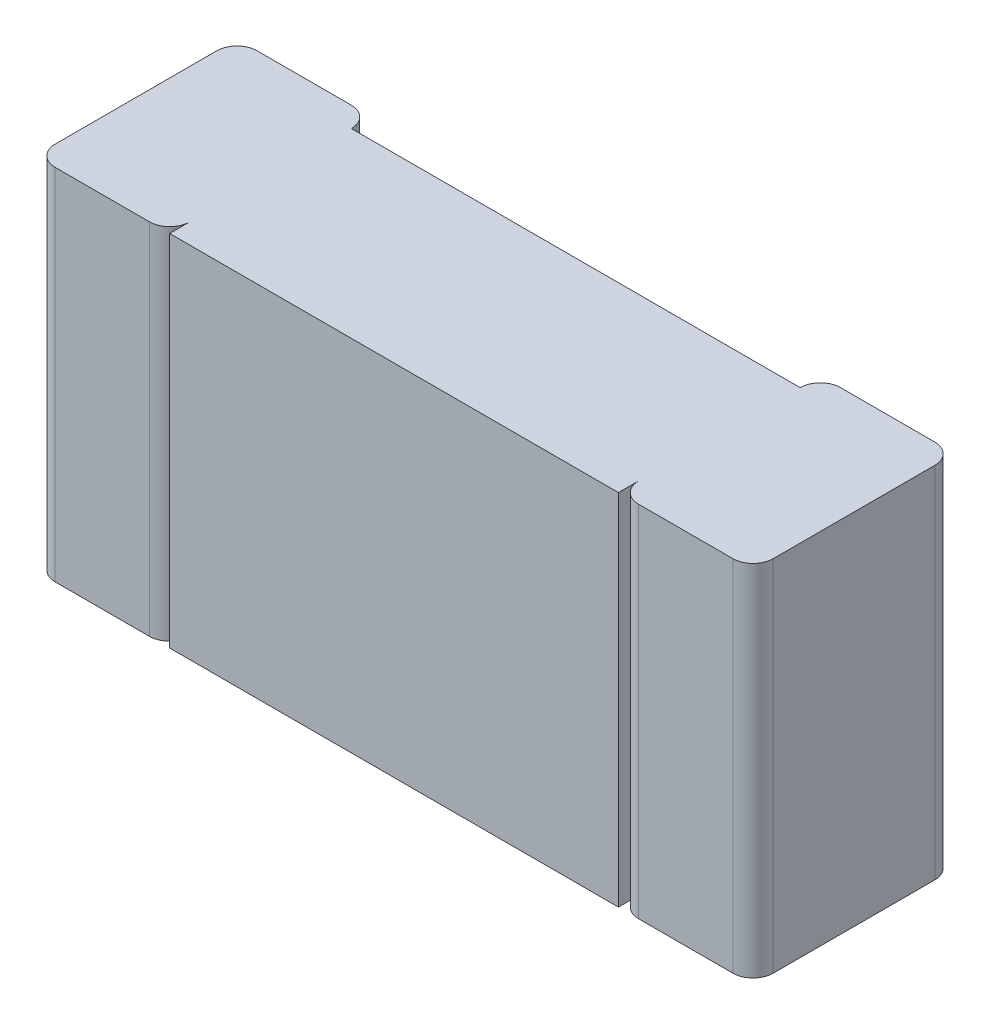
ISO-10303-21;
HEADER;
FILE_DESCRIPTION(('STEP AP214'),'2;1');
FILE_NAME('part.step','',(''),(''),'','','');
FILE_SCHEMA(('AUTOMOTIVE_DESIGN { 1 0 10303 214 1 1 1 1 }'));
ENDSEC;
DATA;
#1=APPLICATION_CONTEXT('core data for automotive mechanical design processes');
#2=APPLICATION_PROTOCOL_DEFINITION('international standard','automotive_design',2000,#1);
#3=PRODUCT_CONTEXT('',#1,'mechanical');
#4=PRODUCT('Part','Part','',(#3));
#5=PRODUCT_RELATED_PRODUCT_CATEGORY('part','',(#4));
#6=PRODUCT_DEFINITION_FORMATION('','',#4);
#7=PRODUCT_DEFINITION_CONTEXT('part definition',#1,'design');
#8=PRODUCT_DEFINITION('design','',#6,#7);
#9=PRODUCT_DEFINITION_SHAPE('','',#8);
#10=(LENGTH_UNIT() NAMED_UNIT(*) SI_UNIT(.MILLI.,.METRE.));
#11=(NAMED_UNIT(*) PLANE_ANGLE_UNIT() SI_UNIT($,.RADIAN.));
#12=(NAMED_UNIT(*) SI_UNIT($,.STERADIAN.) SOLID_ANGLE_UNIT());
#13=UNCERTAINTY_MEASURE_WITH_UNIT(LENGTH_MEASURE(1.E-05),#10,'distance_accuracy_value','');
#14=(GEOMETRIC_REPRESENTATION_CONTEXT(3) GLOBAL_UNCERTAINTY_ASSIGNED_CONTEXT((#13)) GLOBAL_UNIT_ASSIGNED_CONTEXT((#10,
#11,#12)) REPRESENTATION_CONTEXT('',''));
#15=CARTESIAN_POINT('',(0.,0.,0.));
#16=DIRECTION('',(0.,0.,1.));
#17=DIRECTION('',(1.,0.,0.));
#18=AXIS2_PLACEMENT_3D('',#15,#16,#17);
#19=CARTESIAN_POINT('',(-0.755,-0.4,0.045));
#20=DIRECTION('',(0.,1.,0.));
#21=DIRECTION('',(0.,0.,1.));
#22=AXIS2_PLACEMENT_3D('',#19,#20,#21);
#23=CYLINDRICAL_SURFACE('',#22,0.045);
#24=DIRECTION('',(0.,1.,0.));
#25=VECTOR('',#24,1.);
#26=CARTESIAN_POINT('',(-0.755,-0.4,0.));
#27=LINE('',#26,#25);
#28=CARTESIAN_POINT('',(-0.755,0.4,0.));
#29=VERTEX_POINT('',#28);
#30=CARTESIAN_POINT('',(-0.755,-0.4,0.));
#31=VERTEX_POINT('',#30);
#32=EDGE_CURVE('E129',#29,#31,#27,.F.);
#33=ORIENTED_EDGE('',*,*,#32,.T.);
#34=CARTESIAN_POINT('',(-0.755,-0.4,0.045));
#35=DIRECTION('',(0.,1.,0.));
#36=DIRECTION('',(0.,0.,1.));
#37=AXIS2_PLACEMENT_3D('',#34,#35,#36);
#38=CIRCLE('',#37,0.045);
#39=CARTESIAN_POINT('',(-0.8,-0.4,0.045));
#40=VERTEX_POINT('',#39);
#41=EDGE_CURVE('E20',#31,#40,#38,.T.);
#42=ORIENTED_EDGE('',*,*,#41,.T.);
#43=DIRECTION('',(0.,1.,0.));
#44=VECTOR('',#43,1.);
#45=CARTESIAN_POINT('',(-0.8,-0.4,0.045));
#46=LINE('',#45,#44);
#47=CARTESIAN_POINT('',(-0.8,0.4,0.045));
#48=VERTEX_POINT('',#47);
#49=EDGE_CURVE('E136',#40,#48,#46,.T.);
#50=ORIENTED_EDGE('',*,*,#49,.T.);
#51=CARTESIAN_POINT('',(-0.755,0.4,0.045));
#52=DIRECTION('',(0.,1.,0.));
#53=DIRECTION('',(0.,0.,1.));
#54=AXIS2_PLACEMENT_3D('',#51,#52,#53);
#55=CIRCLE('',#54,0.045);
#56=EDGE_CURVE('E232',#29,#48,#55,.T.);
#57=ORIENTED_EDGE('',*,*,#56,.F.);
#58=EDGE_LOOP('',(#33,#42,#50,#57));
#59=FACE_BOUND('',#58,.T.);
#60=ADVANCED_FACE('F17',(#59),#23,.T.);
#61=CARTESIAN_POINT('',(-0.8,-0.4,0.));
#62=DIRECTION('',(1.,0.,0.));
#63=DIRECTION('',(0.,0.,-1.));
#64=AXIS2_PLACEMENT_3D('',#61,#62,#63);
#65=PLANE('',#64);
#66=DIRECTION('',(0.,0.,1.));
#67=VECTOR('',#66,1.);
#68=CARTESIAN_POINT('',(-0.8,0.4,0.));
#69=LINE('',#68,#67);
#70=CARTESIAN_POINT('',(-0.8,0.4,0.405));
#71=VERTEX_POINT('',#70);
#72=EDGE_CURVE('E141',#48,#71,#69,.T.);
#73=ORIENTED_EDGE('',*,*,#72,.F.);
#74=ORIENTED_EDGE('',*,*,#49,.F.);
#75=DIRECTION('',(0.,0.,1.));
#76=VECTOR('',#75,1.);
#77=CARTESIAN_POINT('',(-0.8,-0.4,0.));
#78=LINE('',#77,#76);
#79=CARTESIAN_POINT('',(-0.8,-0.4,0.405));
#80=VERTEX_POINT('',#79);
#81=EDGE_CURVE('E140',#40,#80,#78,.T.);
#82=ORIENTED_EDGE('',*,*,#81,.T.);
#83=DIRECTION('',(0.,1.,0.));
#84=VECTOR('',#83,1.);
#85=CARTESIAN_POINT('',(-0.8,-0.4,0.405));
#86=LINE('',#85,#84);
#87=EDGE_CURVE('E142',#71,#80,#86,.F.);
#88=ORIENTED_EDGE('',*,*,#87,.F.);
#89=EDGE_LOOP('',(#73,#74,#82,#88));
#90=FACE_BOUND('',#89,.T.);
#91=ADVANCED_FACE('F138',(#90),#65,.F.);
#92=CARTESIAN_POINT('',(-0.755,-0.4,0.405));
#93=DIRECTION('',(0.,1.,0.));
#94=DIRECTION('',(0.,0.,1.));
#95=AXIS2_PLACEMENT_3D('',#92,#93,#94);
#96=CYLINDRICAL_SURFACE('',#95,0.045);
#97=CARTESIAN_POINT('',(-0.755,0.4,0.405));
#98=DIRECTION('',(0.,1.,0.));
#99=DIRECTION('',(0.,0.,1.));
#100=AXIS2_PLACEMENT_3D('',#97,#98,#99);
#101=CIRCLE('',#100,0.045);
#102=CARTESIAN_POINT('',(-0.755,0.4,0.45));
#103=VERTEX_POINT('',#102);
#104=EDGE_CURVE('E230',#71,#103,#101,.T.);
#105=ORIENTED_EDGE('',*,*,#104,.F.);
#106=ORIENTED_EDGE('',*,*,#87,.T.);
#107=CARTESIAN_POINT('',(-0.755,-0.4,0.405));
#108=DIRECTION('',(0.,1.,0.));
#109=DIRECTION('',(0.,0.,1.));
#110=AXIS2_PLACEMENT_3D('',#107,#108,#109);
#111=CIRCLE('',#110,0.045);
#112=CARTESIAN_POINT('',(-0.755,-0.4,0.45));
#113=VERTEX_POINT('',#112);
#114=EDGE_CURVE('E151',#80,#113,#111,.T.);
#115=ORIENTED_EDGE('',*,*,#114,.T.);
#116=DIRECTION('',(0.,1.,0.));
#117=VECTOR('',#116,1.);
#118=CARTESIAN_POINT('',(-0.755,-0.4,0.45));
#119=LINE('',#118,#117);
#120=EDGE_CURVE('E200',#103,#113,#119,.F.);
#121=ORIENTED_EDGE('',*,*,#120,.F.);
#122=EDGE_LOOP('',(#105,#106,#115,#121));
#123=FACE_BOUND('',#122,.T.);
#124=ADVANCED_FACE('F457',(#123),#96,.T.);
#125=CARTESIAN_POINT('',(-0.8,-0.4,0.45));
#126=DIRECTION('',(0.,0.,1.));
#127=DIRECTION('',(1.,0.,0.));
#128=AXIS2_PLACEMENT_3D('',#125,#126,#127);
#129=PLANE('',#128);
#130=DIRECTION('',(1.,0.,0.));
#131=VECTOR('',#130,1.);
#132=CARTESIAN_POINT('',(-0.8,-0.4,0.45));
#133=LINE('',#132,#131);
#134=CARTESIAN_POINT('',(-0.545,-0.4,0.45));
#135=VERTEX_POINT('',#134);
#136=EDGE_CURVE('E248',#113,#135,#133,.T.);
#137=ORIENTED_EDGE('',*,*,#136,.T.);
#138=DIRECTION('',(0.,1.,0.));
#139=VECTOR('',#138,1.);
#140=CARTESIAN_POINT('',(-0.545,-0.4,0.45));
#141=LINE('',#140,#139);
#142=CARTESIAN_POINT('',(-0.545,0.4,0.45));
#143=VERTEX_POINT('',#142);
#144=EDGE_CURVE('E198',#143,#135,#141,.F.);
#145=ORIENTED_EDGE('',*,*,#144,.F.);
#146=DIRECTION('',(1.,0.,0.));
#147=VECTOR('',#146,1.);
#148=CARTESIAN_POINT('',(-0.8,0.4,0.45));
#149=LINE('',#148,#147);
#150=EDGE_CURVE('E229',#103,#143,#149,.T.);
#151=ORIENTED_EDGE('',*,*,#150,.F.);
#152=ORIENTED_EDGE('',*,*,#120,.T.);
#153=EDGE_LOOP('',(#137,#145,#151,#152));
#154=FACE_BOUND('',#153,.T.);
#155=ADVANCED_FACE('F447',(#154),#129,.T.);
#156=CARTESIAN_POINT('',(-0.545,-0.4,0.405));
#157=DIRECTION('',(0.,1.,0.));
#158=DIRECTION('',(0.,0.,1.));
#159=AXIS2_PLACEMENT_3D('',#156,#157,#158);
#160=CYLINDRICAL_SURFACE('',#159,0.045);
#161=ORIENTED_EDGE('',*,*,#144,.T.);
#162=CARTESIAN_POINT('',(-0.545,-0.4,0.405));
#163=DIRECTION('',(0.,1.,0.));
#164=DIRECTION('',(0.,0.,1.));
#165=AXIS2_PLACEMENT_3D('',#162,#163,#164);
#166=CIRCLE('',#165,0.045);
#167=CARTESIAN_POINT('',(-0.5,-0.4,0.405));
#168=VERTEX_POINT('',#167);
#169=EDGE_CURVE('E246',#135,#168,#166,.T.);
#170=ORIENTED_EDGE('',*,*,#169,.T.);
#171=DIRECTION('',(0.,1.,0.));
#172=VECTOR('',#171,1.);
#173=CARTESIAN_POINT('',(-0.5,-0.4,0.405));
#174=LINE('',#173,#172);
#175=CARTESIAN_POINT('',(-0.5,0.4,0.405));
#176=VERTEX_POINT('',#175);
#177=EDGE_CURVE('E193',#168,#176,#174,.T.);
#178=ORIENTED_EDGE('',*,*,#177,.T.);
#179=CARTESIAN_POINT('',(-0.545,0.4,0.405));
#180=DIRECTION('',(0.,1.,0.));
#181=DIRECTION('',(0.,0.,1.));
#182=AXIS2_PLACEMENT_3D('',#179,#180,#181);
#183=CIRCLE('',#182,0.045);
#184=EDGE_CURVE('E227',#143,#176,#183,.T.);
#185=ORIENTED_EDGE('',*,*,#184,.F.);
#186=EDGE_LOOP('',(#161,#170,#178,#185));
#187=FACE_BOUND('',#186,.T.);
#188=ADVANCED_FACE('F435',(#187),#160,.T.);
#189=CARTESIAN_POINT('',(-0.5,-0.4,0.405));
#190=DIRECTION('',(1.,0.,0.));
#191=DIRECTION('',(0.,0.,-1.));
#192=AXIS2_PLACEMENT_3D('',#189,#190,#191);
#193=PLANE('',#192);
#194=DIRECTION('',(0.,0.,1.));
#195=VECTOR('',#194,1.);
#196=CARTESIAN_POINT('',(-0.5,0.4,0.405));
#197=LINE('',#196,#195);
#198=CARTESIAN_POINT('',(-0.5,0.4,0.45));
#199=VERTEX_POINT('',#198);
#200=EDGE_CURVE('E188',#176,#199,#197,.T.);
#201=ORIENTED_EDGE('',*,*,#200,.F.);
#202=ORIENTED_EDGE('',*,*,#177,.F.);
#203=DIRECTION('',(0.,0.,1.));
#204=VECTOR('',#203,1.);
#205=CARTESIAN_POINT('',(-0.5,-0.4,0.405));
#206=LINE('',#205,#204);
#207=CARTESIAN_POINT('',(-0.5,-0.4,0.45));
#208=VERTEX_POINT('',#207);
#209=EDGE_CURVE('E206',#168,#208,#206,.T.);
#210=ORIENTED_EDGE('',*,*,#209,.T.);
#211=DIRECTION('',(0.,1.,0.));
#212=VECTOR('',#211,1.);
#213=CARTESIAN_POINT('',(-0.5,-0.4,0.45));
#214=LINE('',#213,#212);
#215=EDGE_CURVE('E181',#199,#208,#214,.F.);
#216=ORIENTED_EDGE('',*,*,#215,.F.);
#217=EDGE_LOOP('',(#201,#202,#210,#216));
#218=FACE_BOUND('',#217,.T.);
#219=ADVANCED_FACE('F425',(#218),#193,.F.);
#220=CARTESIAN_POINT('',(-0.5,-0.4,0.45));
#221=DIRECTION('',(0.,0.,1.));
#222=DIRECTION('',(1.,0.,0.));
#223=AXIS2_PLACEMENT_3D('',#220,#221,#222);
#224=PLANE('',#223);
#225=DIRECTION('',(0.,1.,0.));
#226=VECTOR('',#225,1.);
#227=CARTESIAN_POINT('',(0.5,-0.4,0.45));
#228=LINE('',#227,#226);
#229=CARTESIAN_POINT('',(0.5,0.4,0.45));
#230=VERTEX_POINT('',#229);
#231=CARTESIAN_POINT('',(0.5,-0.4,0.45));
#232=VERTEX_POINT('',#231);
#233=EDGE_CURVE('E174',#230,#232,#228,.F.);
#234=ORIENTED_EDGE('',*,*,#233,.F.);
#235=DIRECTION('',(1.,0.,0.));
#236=VECTOR('',#235,1.);
#237=CARTESIAN_POINT('',(-0.5,0.4,0.45));
#238=LINE('',#237,#236);
#239=EDGE_CURVE('E184',#199,#230,#238,.T.);
#240=ORIENTED_EDGE('',*,*,#239,.F.);
#241=ORIENTED_EDGE('',*,*,#215,.T.);
#242=DIRECTION('',(1.,0.,0.));
#243=VECTOR('',#242,1.);
#244=CARTESIAN_POINT('',(-0.5,-0.4,0.45));
#245=LINE('',#244,#243);
#246=EDGE_CURVE('E203',#208,#232,#245,.T.);
#247=ORIENTED_EDGE('',*,*,#246,.T.);
#248=EDGE_LOOP('',(#234,#240,#241,#247));
#249=FACE_BOUND('',#248,.T.);
#250=ADVANCED_FACE('F412',(#249),#224,.T.);
#251=CARTESIAN_POINT('',(0.5,-0.4,0.405));
#252=DIRECTION('',(1.,0.,0.));
#253=DIRECTION('',(0.,0.,-1.));
#254=AXIS2_PLACEMENT_3D('',#251,#252,#253);
#255=PLANE('',#254);
#256=DIRECTION('',(0.,0.,1.));
#257=VECTOR('',#256,1.);
#258=CARTESIAN_POINT('',(0.5,0.4,0.405));
#259=LINE('',#258,#257);
#260=CARTESIAN_POINT('',(0.5,0.4,0.405));
#261=VERTEX_POINT('',#260);
#262=EDGE_CURVE('E187',#230,#261,#259,.F.);
#263=ORIENTED_EDGE('',*,*,#262,.F.);
#264=ORIENTED_EDGE('',*,*,#233,.T.);
#265=DIRECTION('',(0.,0.,1.));
#266=VECTOR('',#265,1.);
#267=CARTESIAN_POINT('',(0.5,-0.4,0.405));
#268=LINE('',#267,#266);
#269=CARTESIAN_POINT('',(0.5,-0.4,0.405));
#270=VERTEX_POINT('',#269);
#271=EDGE_CURVE('E178',#232,#270,#268,.F.);
#272=ORIENTED_EDGE('',*,*,#271,.T.);
#273=DIRECTION('',(0.,1.,0.));
#274=VECTOR('',#273,1.);
#275=CARTESIAN_POINT('',(0.5,-0.4,0.405));
#276=LINE('',#275,#274);
#277=EDGE_CURVE('E172',#261,#270,#276,.F.);
#278=ORIENTED_EDGE('',*,*,#277,.F.);
#279=EDGE_LOOP('',(#263,#264,#272,#278));
#280=FACE_BOUND('',#279,.T.);
#281=ADVANCED_FACE('F376',(#280),#255,.T.);
#282=CARTESIAN_POINT('',(0.545,-0.4,0.405));
#283=DIRECTION('',(0.,1.,0.));
#284=DIRECTION('',(0.,0.,1.));
#285=AXIS2_PLACEMENT_3D('',#282,#283,#284);
#286=CYLINDRICAL_SURFACE('',#285,0.045);
#287=CARTESIAN_POINT('',(0.545,0.4,0.405));
#288=DIRECTION('',(0.,1.,0.));
#289=DIRECTION('',(0.,0.,1.));
#290=AXIS2_PLACEMENT_3D('',#287,#288,#289);
#291=CIRCLE('',#290,0.045);
#292=CARTESIAN_POINT('',(0.545,0.4,0.45));
#293=VERTEX_POINT('',#292);
#294=EDGE_CURVE('E224',#261,#293,#291,.T.);
#295=ORIENTED_EDGE('',*,*,#294,.F.);
#296=ORIENTED_EDGE('',*,*,#277,.T.);
#297=CARTESIAN_POINT('',(0.545,-0.4,0.405));
#298=DIRECTION('',(0.,1.,0.));
#299=DIRECTION('',(0.,0.,1.));
#300=AXIS2_PLACEMENT_3D('',#297,#298,#299);
#301=CIRCLE('',#300,0.045);
#302=CARTESIAN_POINT('',(0.545,-0.4,0.45));
#303=VERTEX_POINT('',#302);
#304=EDGE_CURVE('E243',#270,#303,#301,.T.);
#305=ORIENTED_EDGE('',*,*,#304,.T.);
#306=DIRECTION('',(0.,1.,0.));
#307=VECTOR('',#306,1.);
#308=CARTESIAN_POINT('',(0.545,-0.4,0.45));
#309=LINE('',#308,#307);
#310=EDGE_CURVE('E170',#293,#303,#309,.F.);
#311=ORIENTED_EDGE('',*,*,#310,.F.);
#312=EDGE_LOOP('',(#295,#296,#305,#311));
#313=FACE_BOUND('',#312,.T.);
#314=ADVANCED_FACE('F411',(#313),#286,.T.);
#315=CARTESIAN_POINT('',(0.5,-0.4,0.45));
#316=DIRECTION('',(0.,0.,1.));
#317=DIRECTION('',(1.,0.,0.));
#318=AXIS2_PLACEMENT_3D('',#315,#316,#317);
#319=PLANE('',#318);
#320=DIRECTION('',(1.,0.,0.));
#321=VECTOR('',#320,1.);
#322=CARTESIAN_POINT('',(0.5,-0.4,0.45));
#323=LINE('',#322,#321);
#324=CARTESIAN_POINT('',(0.755,-0.4,0.45));
#325=VERTEX_POINT('',#324);
#326=EDGE_CURVE('E242',#303,#325,#323,.T.);
#327=ORIENTED_EDGE('',*,*,#326,.T.);
#328=DIRECTION('',(0.,1.,0.));
#329=VECTOR('',#328,1.);
#330=CARTESIAN_POINT('',(0.755,-0.4,0.45));
#331=LINE('',#330,#329);
#332=CARTESIAN_POINT('',(0.755,0.4,0.45));
#333=VERTEX_POINT('',#332);
#334=EDGE_CURVE('E168',#333,#325,#331,.F.);
#335=ORIENTED_EDGE('',*,*,#334,.F.);
#336=DIRECTION('',(1.,0.,0.));
#337=VECTOR('',#336,1.);
#338=CARTESIAN_POINT('',(0.5,0.4,0.45));
#339=LINE('',#338,#337);
#340=EDGE_CURVE('E223',#293,#333,#339,.T.);
#341=ORIENTED_EDGE('',*,*,#340,.F.);
#342=ORIENTED_EDGE('',*,*,#310,.T.);
#343=EDGE_LOOP('',(#327,#335,#341,#342));
#344=FACE_BOUND('',#343,.T.);
#345=ADVANCED_FACE('F488',(#344),#319,.T.);
#346=CARTESIAN_POINT('',(0.755,-0.4,0.405));
#347=DIRECTION('',(0.,1.,0.));
#348=DIRECTION('',(0.,0.,1.));
#349=AXIS2_PLACEMENT_3D('',#346,#347,#348);
#350=CYLINDRICAL_SURFACE('',#349,0.045);
#351=ORIENTED_EDGE('',*,*,#334,.T.);
#352=CARTESIAN_POINT('',(0.755,-0.4,0.405));
#353=DIRECTION('',(0.,1.,0.));
#354=DIRECTION('',(0.,0.,1.));
#355=AXIS2_PLACEMENT_3D('',#352,#353,#354);
#356=CIRCLE('',#355,0.045);
#357=CARTESIAN_POINT('',(0.8,-0.4,0.405));
#358=VERTEX_POINT('',#357);
#359=EDGE_CURVE('E239',#325,#358,#356,.T.);
#360=ORIENTED_EDGE('',*,*,#359,.T.);
#361=DIRECTION('',(0.,1.,0.));
#362=VECTOR('',#361,1.);
#363=CARTESIAN_POINT('',(0.8,-0.4,0.405));
#364=LINE('',#363,#362);
#365=CARTESIAN_POINT('',(0.8,0.4,0.405));
#366=VERTEX_POINT('',#365);
#367=EDGE_CURVE('E166',#366,#358,#364,.F.);
#368=ORIENTED_EDGE('',*,*,#367,.F.);
#369=CARTESIAN_POINT('',(0.755,0.4,0.405));
#370=DIRECTION('',(0.,1.,0.));
#371=DIRECTION('',(0.,0.,1.));
#372=AXIS2_PLACEMENT_3D('',#369,#370,#371);
#373=CIRCLE('',#372,0.045);
#374=EDGE_CURVE('E221',#333,#366,#373,.T.);
#375=ORIENTED_EDGE('',*,*,#374,.F.);
#376=EDGE_LOOP('',(#351,#360,#368,#375));
#377=FACE_BOUND('',#376,.T.);
#378=ADVANCED_FACE('F492',(#377),#350,.T.);
#379=CARTESIAN_POINT('',(0.8,-0.4,0.));
#380=DIRECTION('',(1.,0.,0.));
#381=DIRECTION('',(0.,0.,-1.));
#382=AXIS2_PLACEMENT_3D('',#379,#380,#381);
#383=PLANE('',#382);
#384=DIRECTION('',(0.,0.,1.));
#385=VECTOR('',#384,1.);
#386=CARTESIAN_POINT('',(0.8,0.4,0.));
#387=LINE('',#386,#385);
#388=CARTESIAN_POINT('',(0.8,0.4,0.045));
#389=VERTEX_POINT('',#388);
#390=EDGE_CURVE('E220',#366,#389,#387,.F.);
#391=ORIENTED_EDGE('',*,*,#390,.F.);
#392=ORIENTED_EDGE('',*,*,#367,.T.);
#393=DIRECTION('',(0.,0.,1.));
#394=VECTOR('',#393,1.);
#395=CARTESIAN_POINT('',(0.8,-0.4,0.));
#396=LINE('',#395,#394);
#397=CARTESIAN_POINT('',(0.8,-0.4,0.045));
#398=VERTEX_POINT('',#397);
#399=EDGE_CURVE('E238',#358,#398,#396,.F.);
#400=ORIENTED_EDGE('',*,*,#399,.T.);
#401=DIRECTION('',(0.,1.,0.));
#402=VECTOR('',#401,1.);
#403=CARTESIAN_POINT('',(0.8,-0.4,0.045));
#404=LINE('',#403,#402);
#405=EDGE_CURVE('E157',#389,#398,#404,.F.);
#406=ORIENTED_EDGE('',*,*,#405,.F.);
#407=EDGE_LOOP('',(#391,#392,#400,#406));
#408=FACE_BOUND('',#407,.T.);
#409=ADVANCED_FACE('F298',(#408),#383,.T.);
#410=CARTESIAN_POINT('',(0.755,-0.4,0.045));
#411=DIRECTION('',(0.,1.,0.));
#412=DIRECTION('',(0.,0.,1.));
#413=AXIS2_PLACEMENT_3D('',#410,#411,#412);
#414=CYLINDRICAL_SURFACE('',#413,0.045);
#415=CARTESIAN_POINT('',(0.755,0.4,0.045));
#416=DIRECTION('',(0.,1.,0.));
#417=DIRECTION('',(0.,0.,1.));
#418=AXIS2_PLACEMENT_3D('',#415,#416,#417);
#419=CIRCLE('',#418,0.045);
#420=CARTESIAN_POINT('',(0.755,0.4,0.));
#421=VERTEX_POINT('',#420);
#422=EDGE_CURVE('E217',#389,#421,#419,.T.);
#423=ORIENTED_EDGE('',*,*,#422,.F.);
#424=ORIENTED_EDGE('',*,*,#405,.T.);
#425=CARTESIAN_POINT('',(0.755,-0.4,0.045));
#426=DIRECTION('',(0.,1.,0.));
#427=DIRECTION('',(0.,0.,1.));
#428=AXIS2_PLACEMENT_3D('',#425,#426,#427);
#429=CIRCLE('',#428,0.045);
#430=CARTESIAN_POINT('',(0.755,-0.4,0.));
#431=VERTEX_POINT('',#430);
#432=EDGE_CURVE('E235',#398,#431,#429,.T.);
#433=ORIENTED_EDGE('',*,*,#432,.T.);
#434=DIRECTION('',(0.,1.,0.));
#435=VECTOR('',#434,1.);
#436=CARTESIAN_POINT('',(0.755,-0.4,0.));
#437=LINE('',#436,#435);
#438=EDGE_CURVE('E175',#431,#421,#437,.T.);
#439=ORIENTED_EDGE('',*,*,#438,.T.);
#440=EDGE_LOOP('',(#423,#424,#433,#439));
#441=FACE_BOUND('',#440,.T.);
#442=ADVANCED_FACE('F302',(#441),#414,.T.);
#443=CARTESIAN_POINT('',(-0.8,-0.4,0.));
#444=DIRECTION('',(0.,0.,1.));
#445=DIRECTION('',(1.,0.,0.));
#446=AXIS2_PLACEMENT_3D('',#443,#444,#445);
#447=PLANE('',#446);
#448=DIRECTION('',(1.,0.,0.));
#449=VECTOR('',#448,1.);
#450=CARTESIAN_POINT('',(-0.8,-0.4,0.));
#451=LINE('',#450,#449);
#452=CARTESIAN_POINT('',(-0.545,-0.4,0.));
#453=VERTEX_POINT('',#452);
#454=EDGE_CURVE('E153',#453,#31,#451,.F.);
#455=ORIENTED_EDGE('',*,*,#454,.T.);
#456=ORIENTED_EDGE('',*,*,#32,.F.);
#457=DIRECTION('',(1.,0.,0.));
#458=VECTOR('',#457,1.);
#459=CARTESIAN_POINT('',(-0.8,0.4,0.));
#460=LINE('',#459,#458);
#461=CARTESIAN_POINT('',(-0.545,0.4,0.));
#462=VERTEX_POINT('',#461);
#463=EDGE_CURVE('E234',#462,#29,#460,.F.);
#464=ORIENTED_EDGE('',*,*,#463,.F.);
#465=DIRECTION('',(0.,1.,0.));
#466=VECTOR('',#465,1.);
#467=CARTESIAN_POINT('',(-0.545,-0.4,0.));
#468=LINE('',#467,#466);
#469=EDGE_CURVE('E161',#453,#462,#468,.T.);
#470=ORIENTED_EDGE('',*,*,#469,.F.);
#471=EDGE_LOOP('',(#455,#456,#464,#470));
#472=FACE_BOUND('',#471,.T.);
#473=ADVANCED_FACE('F319',(#472),#447,.F.);
#474=CARTESIAN_POINT('',(0.5,-0.4,0.));
#475=DIRECTION('',(0.,0.,1.));
#476=DIRECTION('',(1.,0.,0.));
#477=AXIS2_PLACEMENT_3D('',#474,#475,#476);
#478=PLANE('',#477);
#479=DIRECTION('',(1.,0.,0.));
#480=VECTOR('',#479,1.);
#481=CARTESIAN_POINT('',(0.5,-0.4,0.));
#482=LINE('',#481,#480);
#483=CARTESIAN_POINT('',(0.545,-0.4,0.));
#484=VERTEX_POINT('',#483);
#485=EDGE_CURVE('E177',#431,#484,#482,.F.);
#486=ORIENTED_EDGE('',*,*,#485,.T.);
#487=DIRECTION('',(0.,1.,0.));
#488=VECTOR('',#487,1.);
#489=CARTESIAN_POINT('',(0.545,-0.4,0.));
#490=LINE('',#489,#488);
#491=CARTESIAN_POINT('',(0.545,0.4,0.));
#492=VERTEX_POINT('',#491);
#493=EDGE_CURVE('E212',#492,#484,#490,.F.);
#494=ORIENTED_EDGE('',*,*,#493,.F.);
#495=DIRECTION('',(1.,0.,0.));
#496=VECTOR('',#495,1.);
#497=CARTESIAN_POINT('',(0.5,0.4,0.));
#498=LINE('',#497,#496);
#499=EDGE_CURVE('E226',#421,#492,#498,.F.);
#500=ORIENTED_EDGE('',*,*,#499,.F.);
#501=ORIENTED_EDGE('',*,*,#438,.F.);
#502=EDGE_LOOP('',(#486,#494,#500,#501));
#503=FACE_BOUND('',#502,.T.);
#504=ADVANCED_FACE('F305',(#503),#478,.F.);
#505=CARTESIAN_POINT('',(-0.545,-0.4,0.045));
#506=DIRECTION('',(0.,1.,0.));
#507=DIRECTION('',(0.,0.,1.));
#508=AXIS2_PLACEMENT_3D('',#505,#506,#507);
#509=CYLINDRICAL_SURFACE('',#508,0.045);
#510=CARTESIAN_POINT('',(-0.545,0.4,0.045));
#511=DIRECTION('',(0.,1.,0.));
#512=DIRECTION('',(0.,0.,1.));
#513=AXIS2_PLACEMENT_3D('',#510,#511,#512);
#514=CIRCLE('',#513,0.045);
#515=CARTESIAN_POINT('',(-0.5,0.4,0.045));
#516=VERTEX_POINT('',#515);
#517=EDGE_CURVE('E163',#462,#516,#514,.F.);
#518=ORIENTED_EDGE('',*,*,#517,.T.);
#519=DIRECTION('',(0.,1.,0.));
#520=VECTOR('',#519,1.);
#521=CARTESIAN_POINT('',(-0.5,-0.4,0.045));
#522=LINE('',#521,#520);
#523=CARTESIAN_POINT('',(-0.5,-0.4,0.045));
#524=VERTEX_POINT('',#523);
#525=EDGE_CURVE('E211',#516,#524,#522,.F.);
#526=ORIENTED_EDGE('',*,*,#525,.T.);
#527=CARTESIAN_POINT('',(-0.545,-0.4,0.045));
#528=DIRECTION('',(0.,1.,0.));
#529=DIRECTION('',(0.,0.,1.));
#530=AXIS2_PLACEMENT_3D('',#527,#528,#529);
#531=CIRCLE('',#530,0.045);
#532=EDGE_CURVE('E164',#524,#453,#531,.T.);
#533=ORIENTED_EDGE('',*,*,#532,.T.);
#534=ORIENTED_EDGE('',*,*,#469,.T.);
#535=EDGE_LOOP('',(#518,#526,#533,#534));
#536=FACE_BOUND('',#535,.T.);
#537=ADVANCED_FACE('F318',(#536),#509,.T.);
#538=CARTESIAN_POINT('',(-0.755,-0.4,0.045));
#539=DIRECTION('',(0.,1.,0.));
#540=DIRECTION('',(0.,0.,1.));
#541=AXIS2_PLACEMENT_3D('',#538,#539,#540);
#542=PLANE('',#541);
#543=DIRECTION('',(1.,0.,0.));
#544=VECTOR('',#543,1.);
#545=CARTESIAN_POINT('',(-0.755,-0.4,0.045));
#546=LINE('',#545,#544);
#547=CARTESIAN_POINT('',(0.5,-0.4,0.045));
#548=VERTEX_POINT('',#547);
#549=EDGE_CURVE('E263',#524,#548,#546,.T.);
#550=ORIENTED_EDGE('',*,*,#549,.T.);
#551=CARTESIAN_POINT('',(0.545,-0.4,0.045));
#552=DIRECTION('',(0.,1.,0.));
#553=DIRECTION('',(0.,0.,1.));
#554=AXIS2_PLACEMENT_3D('',#551,#552,#553);
#555=CIRCLE('',#554,0.045);
#556=EDGE_CURVE('E209',#484,#548,#555,.T.);
#557=ORIENTED_EDGE('',*,*,#556,.F.);
#558=ORIENTED_EDGE('',*,*,#485,.F.);
#559=ORIENTED_EDGE('',*,*,#432,.F.);
#560=ORIENTED_EDGE('',*,*,#399,.F.);
#561=ORIENTED_EDGE('',*,*,#359,.F.);
#562=ORIENTED_EDGE('',*,*,#326,.F.);
#563=ORIENTED_EDGE('',*,*,#304,.F.);
#564=ORIENTED_EDGE('',*,*,#271,.F.);
#565=ORIENTED_EDGE('',*,*,#246,.F.);
#566=ORIENTED_EDGE('',*,*,#209,.F.);
#567=ORIENTED_EDGE('',*,*,#169,.F.);
#568=ORIENTED_EDGE('',*,*,#136,.F.);
#569=ORIENTED_EDGE('',*,*,#114,.F.);
#570=ORIENTED_EDGE('',*,*,#81,.F.);
#571=ORIENTED_EDGE('',*,*,#41,.F.);
#572=ORIENTED_EDGE('',*,*,#454,.F.);
#573=ORIENTED_EDGE('',*,*,#532,.F.);
#574=EDGE_LOOP('',(#550,#557,#558,#559,#560,#561,#562,#563,#564,#565,#566,#567,#568,#569,#570,
#571,#572,#573));
#575=FACE_BOUND('',#574,.T.);
#576=ADVANCED_FACE('F147',(#575),#542,.F.);
#577=CARTESIAN_POINT('',(0.545,-0.4,0.045));
#578=DIRECTION('',(0.,1.,0.));
#579=DIRECTION('',(0.,0.,1.));
#580=AXIS2_PLACEMENT_3D('',#577,#578,#579);
#581=CYLINDRICAL_SURFACE('',#580,0.045);
#582=ORIENTED_EDGE('',*,*,#493,.T.);
#583=ORIENTED_EDGE('',*,*,#556,.T.);
#584=DIRECTION('',(0.,1.,0.));
#585=VECTOR('',#584,1.);
#586=CARTESIAN_POINT('',(0.5,-0.4,0.045));
#587=LINE('',#586,#585);
#588=CARTESIAN_POINT('',(0.5,0.4,0.045));
#589=VERTEX_POINT('',#588);
#590=EDGE_CURVE('E26',#548,#589,#587,.T.);
#591=ORIENTED_EDGE('',*,*,#590,.T.);
#592=CARTESIAN_POINT('',(0.545,0.4,0.045));
#593=DIRECTION('',(0.,1.,0.));
#594=DIRECTION('',(0.,0.,1.));
#595=AXIS2_PLACEMENT_3D('',#592,#593,#594);
#596=CIRCLE('',#595,0.045);
#597=EDGE_CURVE('E34',#589,#492,#596,.F.);
#598=ORIENTED_EDGE('',*,*,#597,.T.);
#599=EDGE_LOOP('',(#582,#583,#591,#598));
#600=FACE_BOUND('',#599,.T.);
#601=ADVANCED_FACE('F311',(#600),#581,.T.);
#602=CARTESIAN_POINT('',(-0.755,0.4,0.045));
#603=DIRECTION('',(0.,1.,0.));
#604=DIRECTION('',(0.,0.,1.));
#605=AXIS2_PLACEMENT_3D('',#602,#603,#604);
#606=PLANE('',#605);
#607=DIRECTION('',(1.,0.,0.));
#608=VECTOR('',#607,1.);
#609=CARTESIAN_POINT('',(-0.755,0.4,0.045));
#610=LINE('',#609,#608);
#611=EDGE_CURVE('E11',#589,#516,#610,.F.);
#612=ORIENTED_EDGE('',*,*,#611,.T.);
#613=ORIENTED_EDGE('',*,*,#517,.F.);
#614=ORIENTED_EDGE('',*,*,#463,.T.);
#615=ORIENTED_EDGE('',*,*,#56,.T.);
#616=ORIENTED_EDGE('',*,*,#72,.T.);
#617=ORIENTED_EDGE('',*,*,#104,.T.);
#618=ORIENTED_EDGE('',*,*,#150,.T.);
#619=ORIENTED_EDGE('',*,*,#184,.T.);
#620=ORIENTED_EDGE('',*,*,#200,.T.);
#621=ORIENTED_EDGE('',*,*,#239,.T.);
#622=ORIENTED_EDGE('',*,*,#262,.T.);
#623=ORIENTED_EDGE('',*,*,#294,.T.);
#624=ORIENTED_EDGE('',*,*,#340,.T.);
#625=ORIENTED_EDGE('',*,*,#374,.T.);
#626=ORIENTED_EDGE('',*,*,#390,.T.);
#627=ORIENTED_EDGE('',*,*,#422,.T.);
#628=ORIENTED_EDGE('',*,*,#499,.T.);
#629=ORIENTED_EDGE('',*,*,#597,.F.);
#630=EDGE_LOOP('',(#612,#613,#614,#615,#616,#617,#618,#619,#620,#621,#622,#623,#624,#625,#626,
#627,#628,#629));
#631=FACE_BOUND('',#630,.T.);
#632=ADVANCED_FACE('F292',(#631),#606,.T.);
#633=CARTESIAN_POINT('',(-0.755,-0.4,0.045));
#634=DIRECTION('',(0.,0.,1.));
#635=DIRECTION('',(1.,0.,0.));
#636=AXIS2_PLACEMENT_3D('',#633,#634,#635);
#637=PLANE('',#636);
#638=ORIENTED_EDGE('',*,*,#590,.F.);
#639=ORIENTED_EDGE('',*,*,#549,.F.);
#640=ORIENTED_EDGE('',*,*,#525,.F.);
#641=ORIENTED_EDGE('',*,*,#611,.F.);
#642=EDGE_LOOP('',(#638,#639,#640,#641));
#643=FACE_BOUND('',#642,.T.);
#644=ADVANCED_FACE('F313',(#643),#637,.F.);
#645=CLOSED_SHELL('',(#60,#91,#124,#155,#188,#219,#250,#281,#314,#345,#378,#409,#442,#473,#504,
#537,#576,#601,#632,#644));
#646=MANIFOLD_SOLID_BREP('B1',#645);
#647=ADVANCED_BREP_SHAPE_REPRESENTATION('',(#18,#646),#14);
#648=SHAPE_DEFINITION_REPRESENTATION(#9,#647);
ENDSEC;
END-ISO-10303-21;
